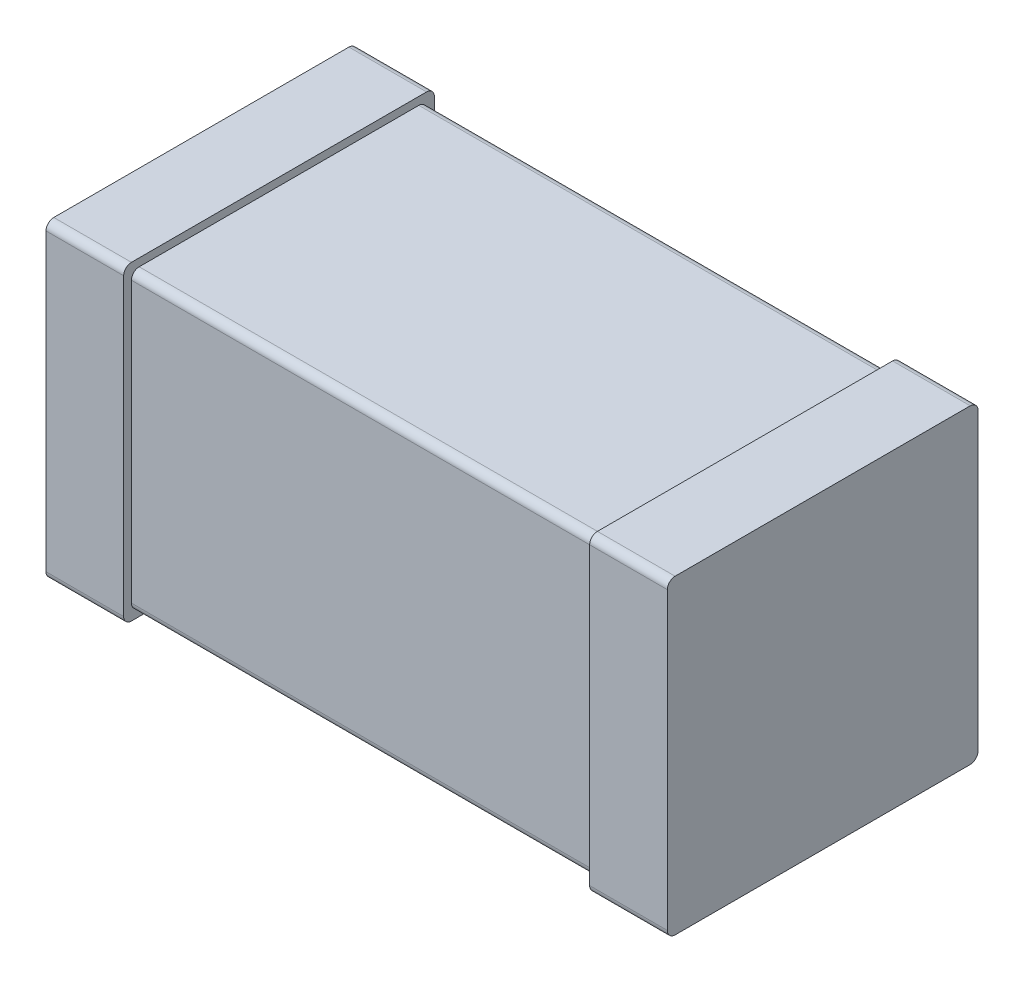
ISO-10303-21;
HEADER;
FILE_DESCRIPTION(('STEP AP214'),'2;1');
FILE_NAME('part.step','',(''),(''),'','','');
FILE_SCHEMA(('AUTOMOTIVE_DESIGN { 1 0 10303 214 1 1 1 1 }'));
ENDSEC;
DATA;
#1=APPLICATION_CONTEXT('core data for automotive mechanical design processes');
#2=APPLICATION_PROTOCOL_DEFINITION('international standard','automotive_design',2000,#1);
#3=PRODUCT_CONTEXT('',#1,'mechanical');
#4=PRODUCT('Part','Part','',(#3));
#5=PRODUCT_RELATED_PRODUCT_CATEGORY('part','',(#4));
#6=PRODUCT_DEFINITION_FORMATION('','',#4);
#7=PRODUCT_DEFINITION_CONTEXT('part definition',#1,'design');
#8=PRODUCT_DEFINITION('design','',#6,#7);
#9=PRODUCT_DEFINITION_SHAPE('','',#8);
#10=(LENGTH_UNIT() NAMED_UNIT(*) SI_UNIT(.MILLI.,.METRE.));
#11=(NAMED_UNIT(*) PLANE_ANGLE_UNIT() SI_UNIT($,.RADIAN.));
#12=(NAMED_UNIT(*) SI_UNIT($,.STERADIAN.) SOLID_ANGLE_UNIT());
#13=UNCERTAINTY_MEASURE_WITH_UNIT(LENGTH_MEASURE(1.E-05),#10,'distance_accuracy_value','');
#14=(GEOMETRIC_REPRESENTATION_CONTEXT(3) GLOBAL_UNCERTAINTY_ASSIGNED_CONTEXT((#13)) GLOBAL_UNIT_ASSIGNED_CONTEXT((#10,
#11,#12)) REPRESENTATION_CONTEXT('',''));
#15=CARTESIAN_POINT('',(0.,0.,0.));
#16=DIRECTION('',(0.,0.,1.));
#17=DIRECTION('',(1.,0.,0.));
#18=AXIS2_PLACEMENT_3D('',#15,#16,#17);
#19=CARTESIAN_POINT('',(-1.6,-0.8,0.));
#20=DIRECTION('',(1.,0.,0.));
#21=DIRECTION('',(0.,1.,0.));
#22=AXIS2_PLACEMENT_3D('',#19,#20,#21);
#23=PLANE('',#22);
#24=CARTESIAN_POINT('',(-1.6,-0.76,1.56));
#25=DIRECTION('',(-1.,0.,0.));
#26=DIRECTION('',(0.,0.,1.));
#27=AXIS2_PLACEMENT_3D('',#24,#25,#26);
#28=CIRCLE('',#27,0.04);
#29=CARTESIAN_POINT('',(-1.6,-0.8,1.56));
#30=VERTEX_POINT('',#29);
#31=CARTESIAN_POINT('',(-1.6,-0.76,1.6));
#32=VERTEX_POINT('',#31);
#33=EDGE_CURVE('E11',#30,#32,#28,.T.);
#34=ORIENTED_EDGE('',*,*,#33,.T.);
#35=DIRECTION('',(0.,1.,0.));
#36=VECTOR('',#35,1.);
#37=CARTESIAN_POINT('',(-1.6,-0.8,1.6));
#38=LINE('',#37,#36);
#39=CARTESIAN_POINT('',(-1.6,0.76,1.6));
#40=VERTEX_POINT('',#39);
#41=EDGE_CURVE('E27',#32,#40,#38,.T.);
#42=ORIENTED_EDGE('',*,*,#41,.T.);
#43=CARTESIAN_POINT('',(-1.6,0.76,1.56));
#44=DIRECTION('',(1.,0.,0.));
#45=DIRECTION('',(0.,0.,1.));
#46=AXIS2_PLACEMENT_3D('',#43,#44,#45);
#47=CIRCLE('',#46,0.04);
#48=CARTESIAN_POINT('',(-1.6,0.8,1.56));
#49=VERTEX_POINT('',#48);
#50=EDGE_CURVE('E331',#49,#40,#47,.T.);
#51=ORIENTED_EDGE('',*,*,#50,.F.);
#52=DIRECTION('',(0.,0.,1.));
#53=VECTOR('',#52,1.);
#54=CARTESIAN_POINT('',(-1.6,0.8,0.));
#55=LINE('',#54,#53);
#56=CARTESIAN_POINT('',(-1.6,0.8,0.04));
#57=VERTEX_POINT('',#56);
#58=EDGE_CURVE('E340',#57,#49,#55,.T.);
#59=ORIENTED_EDGE('',*,*,#58,.F.);
#60=CARTESIAN_POINT('',(-1.6,0.76,0.04));
#61=DIRECTION('',(-1.,0.,0.));
#62=DIRECTION('',(0.,0.,1.));
#63=AXIS2_PLACEMENT_3D('',#60,#61,#62);
#64=CIRCLE('',#63,0.04);
#65=CARTESIAN_POINT('',(-1.6,0.76,0.));
#66=VERTEX_POINT('',#65);
#67=EDGE_CURVE('E400',#57,#66,#64,.T.);
#68=ORIENTED_EDGE('',*,*,#67,.T.);
#69=DIRECTION('',(0.,1.,0.));
#70=VECTOR('',#69,1.);
#71=CARTESIAN_POINT('',(-1.6,-0.8,0.));
#72=LINE('',#71,#70);
#73=CARTESIAN_POINT('',(-1.6,-0.76,0.));
#74=VERTEX_POINT('',#73);
#75=EDGE_CURVE('E304',#74,#66,#72,.T.);
#76=ORIENTED_EDGE('',*,*,#75,.F.);
#77=CARTESIAN_POINT('',(-1.6,-0.76,0.04));
#78=DIRECTION('',(1.,0.,0.));
#79=DIRECTION('',(0.,0.,1.));
#80=AXIS2_PLACEMENT_3D('',#77,#78,#79);
#81=CIRCLE('',#80,0.04);
#82=CARTESIAN_POINT('',(-1.6,-0.8,0.04));
#83=VERTEX_POINT('',#82);
#84=EDGE_CURVE('E293',#83,#74,#81,.T.);
#85=ORIENTED_EDGE('',*,*,#84,.F.);
#86=DIRECTION('',(0.,0.,1.));
#87=VECTOR('',#86,1.);
#88=CARTESIAN_POINT('',(-1.6,-0.8,0.));
#89=LINE('',#88,#87);
#90=EDGE_CURVE('E373',#83,#30,#89,.T.);
#91=ORIENTED_EDGE('',*,*,#90,.T.);
#92=EDGE_LOOP('',(#34,#42,#51,#59,#68,#76,#85,#91));
#93=FACE_BOUND('',#92,.T.);
#94=ADVANCED_FACE('F16',(#93),#23,.F.);
#95=CARTESIAN_POINT('',(-1.6,-0.8,0.));
#96=DIRECTION('',(0.,1.,0.));
#97=DIRECTION('',(1.,0.,0.));
#98=AXIS2_PLACEMENT_3D('',#95,#96,#97);
#99=PLANE('',#98);
#100=DIRECTION('',(1.,0.,0.));
#101=VECTOR('',#100,1.);
#102=CARTESIAN_POINT('',(-1.6,-0.8,1.56));
#103=LINE('',#102,#101);
#104=CARTESIAN_POINT('',(-1.2,-0.8,1.56));
#105=VERTEX_POINT('',#104);
#106=EDGE_CURVE('E412',#30,#105,#103,.T.);
#107=ORIENTED_EDGE('',*,*,#106,.F.);
#108=ORIENTED_EDGE('',*,*,#90,.F.);
#109=DIRECTION('',(1.,0.,0.));
#110=VECTOR('',#109,1.);
#111=CARTESIAN_POINT('',(-1.6,-0.8,0.04));
#112=LINE('',#111,#110);
#113=CARTESIAN_POINT('',(-1.2,-0.8,0.04));
#114=VERTEX_POINT('',#113);
#115=EDGE_CURVE('E369',#83,#114,#112,.T.);
#116=ORIENTED_EDGE('',*,*,#115,.T.);
#117=DIRECTION('',(0.,0.,1.));
#118=VECTOR('',#117,1.);
#119=CARTESIAN_POINT('',(-1.2,-0.8,0.));
#120=LINE('',#119,#118);
#121=EDGE_CURVE('E297',#114,#105,#120,.T.);
#122=ORIENTED_EDGE('',*,*,#121,.T.);
#123=EDGE_LOOP('',(#107,#108,#116,#122));
#124=FACE_BOUND('',#123,.T.);
#125=ADVANCED_FACE('F620',(#124),#99,.F.);
#126=CARTESIAN_POINT('',(-1.6,-0.76,0.04));
#127=DIRECTION('',(1.,0.,0.));
#128=DIRECTION('',(0.,-1.,0.));
#129=AXIS2_PLACEMENT_3D('',#126,#127,#128);
#130=CYLINDRICAL_SURFACE('',#129,0.04);
#131=ORIENTED_EDGE('',*,*,#84,.T.);
#132=DIRECTION('',(1.,0.,0.));
#133=VECTOR('',#132,1.);
#134=CARTESIAN_POINT('',(-1.6,-0.76,0.));
#135=LINE('',#134,#133);
#136=CARTESIAN_POINT('',(-1.2,-0.76,0.));
#137=VERTEX_POINT('',#136);
#138=EDGE_CURVE('E298',#74,#137,#135,.T.);
#139=ORIENTED_EDGE('',*,*,#138,.T.);
#140=CARTESIAN_POINT('',(-1.2,-0.76,0.04));
#141=DIRECTION('',(1.,0.,0.));
#142=DIRECTION('',(0.,0.,1.));
#143=AXIS2_PLACEMENT_3D('',#140,#141,#142);
#144=CIRCLE('',#143,0.04);
#145=EDGE_CURVE('E287',#114,#137,#144,.T.);
#146=ORIENTED_EDGE('',*,*,#145,.F.);
#147=ORIENTED_EDGE('',*,*,#115,.F.);
#148=EDGE_LOOP('',(#131,#139,#146,#147));
#149=FACE_BOUND('',#148,.T.);
#150=ADVANCED_FACE('F616',(#149),#130,.T.);
#151=CARTESIAN_POINT('',(-1.6,-0.76,1.56));
#152=DIRECTION('',(1.,0.,0.));
#153=DIRECTION('',(0.,-1.,0.));
#154=AXIS2_PLACEMENT_3D('',#151,#152,#153);
#155=CYLINDRICAL_SURFACE('',#154,0.04);
#156=ORIENTED_EDGE('',*,*,#106,.T.);
#157=CARTESIAN_POINT('',(-1.2,-0.76,1.56));
#158=DIRECTION('',(-1.,0.,0.));
#159=DIRECTION('',(0.,0.,1.));
#160=AXIS2_PLACEMENT_3D('',#157,#158,#159);
#161=CIRCLE('',#160,0.04);
#162=CARTESIAN_POINT('',(-1.2,-0.76,1.6));
#163=VERTEX_POINT('',#162);
#164=EDGE_CURVE('E303',#105,#163,#161,.T.);
#165=ORIENTED_EDGE('',*,*,#164,.T.);
#166=DIRECTION('',(1.,0.,0.));
#167=VECTOR('',#166,1.);
#168=CARTESIAN_POINT('',(-1.6,-0.76,1.6));
#169=LINE('',#168,#167);
#170=EDGE_CURVE('E408',#32,#163,#169,.T.);
#171=ORIENTED_EDGE('',*,*,#170,.F.);
#172=ORIENTED_EDGE('',*,*,#33,.F.);
#173=EDGE_LOOP('',(#156,#165,#171,#172));
#174=FACE_BOUND('',#173,.T.);
#175=ADVANCED_FACE('F529',(#174),#155,.T.);
#176=CARTESIAN_POINT('',(-1.6,-0.8,0.));
#177=DIRECTION('',(0.,0.,1.));
#178=DIRECTION('',(1.,0.,0.));
#179=AXIS2_PLACEMENT_3D('',#176,#177,#178);
#180=PLANE('',#179);
#181=DIRECTION('',(1.,0.,0.));
#182=VECTOR('',#181,1.);
#183=CARTESIAN_POINT('',(-1.6,0.76,0.));
#184=LINE('',#183,#182);
#185=CARTESIAN_POINT('',(-1.2,0.76,0.));
#186=VERTEX_POINT('',#185);
#187=EDGE_CURVE('E299',#66,#186,#184,.T.);
#188=ORIENTED_EDGE('',*,*,#187,.T.);
#189=DIRECTION('',(0.,1.,0.));
#190=VECTOR('',#189,1.);
#191=CARTESIAN_POINT('',(-1.2,-0.8,0.));
#192=LINE('',#191,#190);
#193=EDGE_CURVE('E351',#137,#186,#192,.T.);
#194=ORIENTED_EDGE('',*,*,#193,.F.);
#195=ORIENTED_EDGE('',*,*,#138,.F.);
#196=ORIENTED_EDGE('',*,*,#75,.T.);
#197=EDGE_LOOP('',(#188,#194,#195,#196));
#198=FACE_BOUND('',#197,.T.);
#199=ADVANCED_FACE('F524',(#198),#180,.F.);
#200=CARTESIAN_POINT('',(-1.6,-0.8,1.6));
#201=DIRECTION('',(0.,0.,1.));
#202=DIRECTION('',(1.,0.,0.));
#203=AXIS2_PLACEMENT_3D('',#200,#201,#202);
#204=PLANE('',#203);
#205=ORIENTED_EDGE('',*,*,#41,.F.);
#206=ORIENTED_EDGE('',*,*,#170,.T.);
#207=DIRECTION('',(0.,1.,0.));
#208=VECTOR('',#207,1.);
#209=CARTESIAN_POINT('',(-1.2,-0.8,1.6));
#210=LINE('',#209,#208);
#211=CARTESIAN_POINT('',(-1.2,0.76,1.6));
#212=VERTEX_POINT('',#211);
#213=EDGE_CURVE('E405',#163,#212,#210,.T.);
#214=ORIENTED_EDGE('',*,*,#213,.T.);
#215=DIRECTION('',(1.,0.,0.));
#216=VECTOR('',#215,1.);
#217=CARTESIAN_POINT('',(-1.6,0.76,1.6));
#218=LINE('',#217,#216);
#219=EDGE_CURVE('E333',#40,#212,#218,.T.);
#220=ORIENTED_EDGE('',*,*,#219,.F.);
#221=EDGE_LOOP('',(#205,#206,#214,#220));
#222=FACE_BOUND('',#221,.T.);
#223=ADVANCED_FACE('F528',(#222),#204,.T.);
#224=CARTESIAN_POINT('',(-1.6,0.76,0.04));
#225=DIRECTION('',(1.,0.,0.));
#226=DIRECTION('',(0.,1.,0.));
#227=AXIS2_PLACEMENT_3D('',#224,#225,#226);
#228=CYLINDRICAL_SURFACE('',#227,0.04);
#229=DIRECTION('',(1.,0.,0.));
#230=VECTOR('',#229,1.);
#231=CARTESIAN_POINT('',(-1.6,0.8,0.04));
#232=LINE('',#231,#230);
#233=CARTESIAN_POINT('',(-1.2,0.8,0.04));
#234=VERTEX_POINT('',#233);
#235=EDGE_CURVE('E337',#57,#234,#232,.T.);
#236=ORIENTED_EDGE('',*,*,#235,.T.);
#237=CARTESIAN_POINT('',(-1.2,0.76,0.04));
#238=DIRECTION('',(-1.,0.,0.));
#239=DIRECTION('',(0.,0.,1.));
#240=AXIS2_PLACEMENT_3D('',#237,#238,#239);
#241=CIRCLE('',#240,0.04);
#242=EDGE_CURVE('E127',#234,#186,#241,.T.);
#243=ORIENTED_EDGE('',*,*,#242,.T.);
#244=ORIENTED_EDGE('',*,*,#187,.F.);
#245=ORIENTED_EDGE('',*,*,#67,.F.);
#246=EDGE_LOOP('',(#236,#243,#244,#245));
#247=FACE_BOUND('',#246,.T.);
#248=ADVANCED_FACE('F548',(#247),#228,.T.);
#249=CARTESIAN_POINT('',(-1.6,0.76,1.56));
#250=DIRECTION('',(1.,0.,0.));
#251=DIRECTION('',(0.,1.,0.));
#252=AXIS2_PLACEMENT_3D('',#249,#250,#251);
#253=CYLINDRICAL_SURFACE('',#252,0.04);
#254=ORIENTED_EDGE('',*,*,#50,.T.);
#255=ORIENTED_EDGE('',*,*,#219,.T.);
#256=CARTESIAN_POINT('',(-1.2,0.76,1.56));
#257=DIRECTION('',(1.,0.,0.));
#258=DIRECTION('',(0.,0.,1.));
#259=AXIS2_PLACEMENT_3D('',#256,#257,#258);
#260=CIRCLE('',#259,0.04);
#261=CARTESIAN_POINT('',(-1.2,0.8,1.56));
#262=VERTEX_POINT('',#261);
#263=EDGE_CURVE('E142',#262,#212,#260,.T.);
#264=ORIENTED_EDGE('',*,*,#263,.F.);
#265=DIRECTION('',(1.,0.,0.));
#266=VECTOR('',#265,1.);
#267=CARTESIAN_POINT('',(-1.6,0.8,1.56));
#268=LINE('',#267,#266);
#269=EDGE_CURVE('E347',#49,#262,#268,.T.);
#270=ORIENTED_EDGE('',*,*,#269,.F.);
#271=EDGE_LOOP('',(#254,#255,#264,#270));
#272=FACE_BOUND('',#271,.T.);
#273=ADVANCED_FACE('F552',(#272),#253,.T.);
#274=CARTESIAN_POINT('',(-1.6,0.8,0.));
#275=DIRECTION('',(0.,1.,0.));
#276=DIRECTION('',(1.,0.,0.));
#277=AXIS2_PLACEMENT_3D('',#274,#275,#276);
#278=PLANE('',#277);
#279=DIRECTION('',(0.,0.,1.));
#280=VECTOR('',#279,1.);
#281=CARTESIAN_POINT('',(-1.2,0.8,0.));
#282=LINE('',#281,#280);
#283=EDGE_CURVE('E450',#234,#262,#282,.T.);
#284=ORIENTED_EDGE('',*,*,#283,.F.);
#285=ORIENTED_EDGE('',*,*,#235,.F.);
#286=ORIENTED_EDGE('',*,*,#58,.T.);
#287=ORIENTED_EDGE('',*,*,#269,.T.);
#288=EDGE_LOOP('',(#284,#285,#286,#287));
#289=FACE_BOUND('',#288,.T.);
#290=ADVANCED_FACE('F630',(#289),#278,.T.);
#291=CARTESIAN_POINT('',(-1.2,-0.8,0.));
#292=DIRECTION('',(1.,0.,0.));
#293=DIRECTION('',(0.,1.,0.));
#294=AXIS2_PLACEMENT_3D('',#291,#292,#293);
#295=PLANE('',#294);
#296=ORIENTED_EDGE('',*,*,#121,.F.);
#297=ORIENTED_EDGE('',*,*,#145,.T.);
#298=ORIENTED_EDGE('',*,*,#193,.T.);
#299=ORIENTED_EDGE('',*,*,#242,.F.);
#300=ORIENTED_EDGE('',*,*,#283,.T.);
#301=ORIENTED_EDGE('',*,*,#263,.T.);
#302=ORIENTED_EDGE('',*,*,#213,.F.);
#303=ORIENTED_EDGE('',*,*,#164,.F.);
#304=EDGE_LOOP('',(#296,#297,#298,#299,#300,#301,#302,#303));
#305=FACE_BOUND('',#304,.T.);
#306=CARTESIAN_POINT('',(-1.2,-0.72,0.08));
#307=DIRECTION('',(1.,0.,0.));
#308=DIRECTION('',(0.,0.,1.));
#309=AXIS2_PLACEMENT_3D('',#306,#307,#308);
#310=CIRCLE('',#309,0.04);
#311=CARTESIAN_POINT('',(-1.2,-0.76,0.08));
#312=VERTEX_POINT('',#311);
#313=CARTESIAN_POINT('',(-1.2,-0.72,0.04));
#314=VERTEX_POINT('',#313);
#315=EDGE_CURVE('E305',#312,#314,#310,.T.);
#316=ORIENTED_EDGE('',*,*,#315,.F.);
#317=DIRECTION('',(0.,0.,1.));
#318=VECTOR('',#317,1.);
#319=CARTESIAN_POINT('',(-1.2,-0.76,0.04));
#320=LINE('',#319,#318);
#321=CARTESIAN_POINT('',(-1.2,-0.76,1.52));
#322=VERTEX_POINT('',#321);
#323=EDGE_CURVE('E418',#312,#322,#320,.T.);
#324=ORIENTED_EDGE('',*,*,#323,.T.);
#325=CARTESIAN_POINT('',(-1.2,-0.72,1.52));
#326=DIRECTION('',(-1.,0.,0.));
#327=DIRECTION('',(0.,0.,1.));
#328=AXIS2_PLACEMENT_3D('',#325,#326,#327);
#329=CIRCLE('',#328,0.04);
#330=CARTESIAN_POINT('',(-1.2,-0.72,1.56));
#331=VERTEX_POINT('',#330);
#332=EDGE_CURVE('E391',#322,#331,#329,.T.);
#333=ORIENTED_EDGE('',*,*,#332,.T.);
#334=DIRECTION('',(0.,1.,0.));
#335=VECTOR('',#334,1.);
#336=CARTESIAN_POINT('',(-1.2,-0.76,1.56));
#337=LINE('',#336,#335);
#338=CARTESIAN_POINT('',(-1.2,0.72,1.56));
#339=VERTEX_POINT('',#338);
#340=EDGE_CURVE('E387',#331,#339,#337,.T.);
#341=ORIENTED_EDGE('',*,*,#340,.T.);
#342=CARTESIAN_POINT('',(-1.2,0.72,1.52));
#343=DIRECTION('',(1.,0.,0.));
#344=DIRECTION('',(0.,0.,1.));
#345=AXIS2_PLACEMENT_3D('',#342,#343,#344);
#346=CIRCLE('',#345,0.04);
#347=CARTESIAN_POINT('',(-1.2,0.76,1.52));
#348=VERTEX_POINT('',#347);
#349=EDGE_CURVE('E326',#348,#339,#346,.T.);
#350=ORIENTED_EDGE('',*,*,#349,.F.);
#351=DIRECTION('',(0.,0.,1.));
#352=VECTOR('',#351,1.);
#353=CARTESIAN_POINT('',(-1.2,0.76,0.04));
#354=LINE('',#353,#352);
#355=CARTESIAN_POINT('',(-1.2,0.76,0.08));
#356=VERTEX_POINT('',#355);
#357=EDGE_CURVE('E395',#356,#348,#354,.T.);
#358=ORIENTED_EDGE('',*,*,#357,.F.);
#359=CARTESIAN_POINT('',(-1.2,0.72,0.08));
#360=DIRECTION('',(-1.,0.,0.));
#361=DIRECTION('',(0.,0.,1.));
#362=AXIS2_PLACEMENT_3D('',#359,#360,#361);
#363=CIRCLE('',#362,0.04);
#364=CARTESIAN_POINT('',(-1.2,0.72,0.04));
#365=VERTEX_POINT('',#364);
#366=EDGE_CURVE('E309',#356,#365,#363,.T.);
#367=ORIENTED_EDGE('',*,*,#366,.T.);
#368=DIRECTION('',(0.,1.,0.));
#369=VECTOR('',#368,1.);
#370=CARTESIAN_POINT('',(-1.2,-0.76,0.04));
#371=LINE('',#370,#369);
#372=EDGE_CURVE('E311',#314,#365,#371,.T.);
#373=ORIENTED_EDGE('',*,*,#372,.F.);
#374=EDGE_LOOP('',(#316,#324,#333,#341,#350,#358,#367,#373));
#375=FACE_BOUND('',#374,.T.);
#376=ADVANCED_FACE('F488',(#305,#375),#295,.T.);
#377=CARTESIAN_POINT('',(-1.2,-0.72,0.08));
#378=DIRECTION('',(1.,0.,0.));
#379=DIRECTION('',(0.,-1.,0.));
#380=AXIS2_PLACEMENT_3D('',#377,#378,#379);
#381=CYLINDRICAL_SURFACE('',#380,0.04);
#382=ORIENTED_EDGE('',*,*,#315,.T.);
#383=DIRECTION('',(1.,0.,0.));
#384=VECTOR('',#383,1.);
#385=CARTESIAN_POINT('',(-1.2,-0.72,0.04));
#386=LINE('',#385,#384);
#387=CARTESIAN_POINT('',(1.2,-0.72,0.04));
#388=VERTEX_POINT('',#387);
#389=EDGE_CURVE('E310',#314,#388,#386,.T.);
#390=ORIENTED_EDGE('',*,*,#389,.T.);
#391=CARTESIAN_POINT('',(1.2,-0.72,0.08));
#392=DIRECTION('',(1.,0.,0.));
#393=DIRECTION('',(0.,0.,1.));
#394=AXIS2_PLACEMENT_3D('',#391,#392,#393);
#395=CIRCLE('',#394,0.04);
#396=CARTESIAN_POINT('',(1.2,-0.76,0.08));
#397=VERTEX_POINT('',#396);
#398=EDGE_CURVE('E291',#397,#388,#395,.T.);
#399=ORIENTED_EDGE('',*,*,#398,.F.);
#400=DIRECTION('',(1.,0.,0.));
#401=VECTOR('',#400,1.);
#402=CARTESIAN_POINT('',(-1.2,-0.76,0.08));
#403=LINE('',#402,#401);
#404=EDGE_CURVE('E365',#312,#397,#403,.T.);
#405=ORIENTED_EDGE('',*,*,#404,.F.);
#406=EDGE_LOOP('',(#382,#390,#399,#405));
#407=FACE_BOUND('',#406,.T.);
#408=ADVANCED_FACE('F536',(#407),#381,.T.);
#409=CARTESIAN_POINT('',(-1.2,-0.76,0.04));
#410=DIRECTION('',(0.,0.,1.));
#411=DIRECTION('',(1.,0.,0.));
#412=AXIS2_PLACEMENT_3D('',#409,#410,#411);
#413=PLANE('',#412);
#414=DIRECTION('',(1.,0.,0.));
#415=VECTOR('',#414,1.);
#416=CARTESIAN_POINT('',(-1.2,0.72,0.04));
#417=LINE('',#416,#415);
#418=CARTESIAN_POINT('',(1.2,0.72,0.04));
#419=VERTEX_POINT('',#418);
#420=EDGE_CURVE('E314',#365,#419,#417,.T.);
#421=ORIENTED_EDGE('',*,*,#420,.T.);
#422=DIRECTION('',(0.,1.,0.));
#423=VECTOR('',#422,1.);
#424=CARTESIAN_POINT('',(1.2,-0.76,0.04));
#425=LINE('',#424,#423);
#426=EDGE_CURVE('E259',#388,#419,#425,.T.);
#427=ORIENTED_EDGE('',*,*,#426,.F.);
#428=ORIENTED_EDGE('',*,*,#389,.F.);
#429=ORIENTED_EDGE('',*,*,#372,.T.);
#430=EDGE_LOOP('',(#421,#427,#428,#429));
#431=FACE_BOUND('',#430,.T.);
#432=ADVANCED_FACE('F540',(#431),#413,.F.);
#433=CARTESIAN_POINT('',(-1.2,0.72,0.08));
#434=DIRECTION('',(1.,0.,0.));
#435=DIRECTION('',(0.,1.,0.));
#436=AXIS2_PLACEMENT_3D('',#433,#434,#435);
#437=CYLINDRICAL_SURFACE('',#436,0.04);
#438=DIRECTION('',(1.,0.,0.));
#439=VECTOR('',#438,1.);
#440=CARTESIAN_POINT('',(-1.2,0.76,0.08));
#441=LINE('',#440,#439);
#442=CARTESIAN_POINT('',(1.2,0.76,0.08));
#443=VERTEX_POINT('',#442);
#444=EDGE_CURVE('E315',#356,#443,#441,.T.);
#445=ORIENTED_EDGE('',*,*,#444,.T.);
#446=CARTESIAN_POINT('',(1.2,0.72,0.08));
#447=DIRECTION('',(-1.,0.,0.));
#448=DIRECTION('',(0.,0.,1.));
#449=AXIS2_PLACEMENT_3D('',#446,#447,#448);
#450=CIRCLE('',#449,0.04);
#451=EDGE_CURVE('E325',#443,#419,#450,.T.);
#452=ORIENTED_EDGE('',*,*,#451,.T.);
#453=ORIENTED_EDGE('',*,*,#420,.F.);
#454=ORIENTED_EDGE('',*,*,#366,.F.);
#455=EDGE_LOOP('',(#445,#452,#453,#454));
#456=FACE_BOUND('',#455,.T.);
#457=ADVANCED_FACE('F505',(#456),#437,.T.);
#458=CARTESIAN_POINT('',(-1.2,0.76,0.04));
#459=DIRECTION('',(0.,1.,0.));
#460=DIRECTION('',(1.,0.,0.));
#461=AXIS2_PLACEMENT_3D('',#458,#459,#460);
#462=PLANE('',#461);
#463=DIRECTION('',(0.,0.,1.));
#464=VECTOR('',#463,1.);
#465=CARTESIAN_POINT('',(1.2,0.76,0.04));
#466=LINE('',#465,#464);
#467=CARTESIAN_POINT('',(1.2,0.76,1.52));
#468=VERTEX_POINT('',#467);
#469=EDGE_CURVE('E290',#443,#468,#466,.T.);
#470=ORIENTED_EDGE('',*,*,#469,.F.);
#471=ORIENTED_EDGE('',*,*,#444,.F.);
#472=ORIENTED_EDGE('',*,*,#357,.T.);
#473=DIRECTION('',(1.,0.,0.));
#474=VECTOR('',#473,1.);
#475=CARTESIAN_POINT('',(-1.2,0.76,1.52));
#476=LINE('',#475,#474);
#477=EDGE_CURVE('E328',#348,#468,#476,.T.);
#478=ORIENTED_EDGE('',*,*,#477,.T.);
#479=EDGE_LOOP('',(#470,#471,#472,#478));
#480=FACE_BOUND('',#479,.T.);
#481=ADVANCED_FACE('F499',(#480),#462,.T.);
#482=CARTESIAN_POINT('',(-1.2,0.72,1.52));
#483=DIRECTION('',(1.,0.,0.));
#484=DIRECTION('',(0.,1.,0.));
#485=AXIS2_PLACEMENT_3D('',#482,#483,#484);
#486=CYLINDRICAL_SURFACE('',#485,0.04);
#487=ORIENTED_EDGE('',*,*,#349,.T.);
#488=DIRECTION('',(1.,0.,0.));
#489=VECTOR('',#488,1.);
#490=CARTESIAN_POINT('',(-1.2,0.72,1.56));
#491=LINE('',#490,#489);
#492=CARTESIAN_POINT('',(1.2,0.72,1.56));
#493=VERTEX_POINT('',#492);
#494=EDGE_CURVE('E329',#339,#493,#491,.T.);
#495=ORIENTED_EDGE('',*,*,#494,.T.);
#496=CARTESIAN_POINT('',(1.2,0.72,1.52));
#497=DIRECTION('',(1.,0.,0.));
#498=DIRECTION('',(0.,0.,1.));
#499=AXIS2_PLACEMENT_3D('',#496,#497,#498);
#500=CIRCLE('',#499,0.04);
#501=EDGE_CURVE('E289',#468,#493,#500,.T.);
#502=ORIENTED_EDGE('',*,*,#501,.F.);
#503=ORIENTED_EDGE('',*,*,#477,.F.);
#504=EDGE_LOOP('',(#487,#495,#502,#503));
#505=FACE_BOUND('',#504,.T.);
#506=ADVANCED_FACE('F18',(#505),#486,.T.);
#507=CARTESIAN_POINT('',(-1.2,-0.76,1.56));
#508=DIRECTION('',(0.,0.,1.));
#509=DIRECTION('',(1.,0.,0.));
#510=AXIS2_PLACEMENT_3D('',#507,#508,#509);
#511=PLANE('',#510);
#512=ORIENTED_EDGE('',*,*,#340,.F.);
#513=DIRECTION('',(1.,0.,0.));
#514=VECTOR('',#513,1.);
#515=CARTESIAN_POINT('',(-1.2,-0.72,1.56));
#516=LINE('',#515,#514);
#517=CARTESIAN_POINT('',(1.2,-0.72,1.56));
#518=VERTEX_POINT('',#517);
#519=EDGE_CURVE('E356',#331,#518,#516,.T.);
#520=ORIENTED_EDGE('',*,*,#519,.T.);
#521=DIRECTION('',(0.,1.,0.));
#522=VECTOR('',#521,1.);
#523=CARTESIAN_POINT('',(1.2,-0.76,1.56));
#524=LINE('',#523,#522);
#525=EDGE_CURVE('E353',#518,#493,#524,.T.);
#526=ORIENTED_EDGE('',*,*,#525,.T.);
#527=ORIENTED_EDGE('',*,*,#494,.F.);
#528=EDGE_LOOP('',(#512,#520,#526,#527));
#529=FACE_BOUND('',#528,.T.);
#530=ADVANCED_FACE('F475',(#529),#511,.T.);
#531=CARTESIAN_POINT('',(-1.2,-0.72,1.52));
#532=DIRECTION('',(1.,0.,0.));
#533=DIRECTION('',(0.,-1.,0.));
#534=AXIS2_PLACEMENT_3D('',#531,#532,#533);
#535=CYLINDRICAL_SURFACE('',#534,0.04);
#536=DIRECTION('',(1.,0.,0.));
#537=VECTOR('',#536,1.);
#538=CARTESIAN_POINT('',(-1.2,-0.76,1.52));
#539=LINE('',#538,#537);
#540=CARTESIAN_POINT('',(1.2,-0.76,1.52));
#541=VERTEX_POINT('',#540);
#542=EDGE_CURVE('E357',#322,#541,#539,.T.);
#543=ORIENTED_EDGE('',*,*,#542,.T.);
#544=CARTESIAN_POINT('',(1.2,-0.72,1.52));
#545=DIRECTION('',(-1.,0.,0.));
#546=DIRECTION('',(0.,0.,1.));
#547=AXIS2_PLACEMENT_3D('',#544,#545,#546);
#548=CIRCLE('',#547,0.04);
#549=EDGE_CURVE('E361',#541,#518,#548,.T.);
#550=ORIENTED_EDGE('',*,*,#549,.T.);
#551=ORIENTED_EDGE('',*,*,#519,.F.);
#552=ORIENTED_EDGE('',*,*,#332,.F.);
#553=EDGE_LOOP('',(#543,#550,#551,#552));
#554=FACE_BOUND('',#553,.T.);
#555=ADVANCED_FACE('F478',(#554),#535,.T.);
#556=CARTESIAN_POINT('',(-1.2,-0.76,0.04));
#557=DIRECTION('',(0.,1.,0.));
#558=DIRECTION('',(1.,0.,0.));
#559=AXIS2_PLACEMENT_3D('',#556,#557,#558);
#560=PLANE('',#559);
#561=ORIENTED_EDGE('',*,*,#542,.F.);
#562=ORIENTED_EDGE('',*,*,#323,.F.);
#563=ORIENTED_EDGE('',*,*,#404,.T.);
#564=DIRECTION('',(0.,0.,1.));
#565=VECTOR('',#564,1.);
#566=CARTESIAN_POINT('',(1.2,-0.76,0.04));
#567=LINE('',#566,#565);
#568=EDGE_CURVE('E20',#397,#541,#567,.T.);
#569=ORIENTED_EDGE('',*,*,#568,.T.);
#570=EDGE_LOOP('',(#561,#562,#563,#569));
#571=FACE_BOUND('',#570,.T.);
#572=ADVANCED_FACE('F492',(#571),#560,.F.);
#573=CARTESIAN_POINT('',(1.2,-0.8,0.));
#574=DIRECTION('',(1.,0.,0.));
#575=DIRECTION('',(0.,1.,0.));
#576=AXIS2_PLACEMENT_3D('',#573,#574,#575);
#577=PLANE('',#576);
#578=CARTESIAN_POINT('',(1.2,-0.76,1.56));
#579=DIRECTION('',(-1.,0.,0.));
#580=DIRECTION('',(0.,0.,1.));
#581=AXIS2_PLACEMENT_3D('',#578,#579,#580);
#582=CIRCLE('',#581,0.04);
#583=CARTESIAN_POINT('',(1.2,-0.8,1.56));
#584=VERTEX_POINT('',#583);
#585=CARTESIAN_POINT('',(1.2,-0.76,1.6));
#586=VERTEX_POINT('',#585);
#587=EDGE_CURVE('E250',#584,#586,#582,.T.);
#588=ORIENTED_EDGE('',*,*,#587,.T.);
#589=DIRECTION('',(0.,1.,0.));
#590=VECTOR('',#589,1.);
#591=CARTESIAN_POINT('',(1.2,-0.8,1.6));
#592=LINE('',#591,#590);
#593=CARTESIAN_POINT('',(1.2,0.76,1.6));
#594=VERTEX_POINT('',#593);
#595=EDGE_CURVE('E268',#586,#594,#592,.T.);
#596=ORIENTED_EDGE('',*,*,#595,.T.);
#597=CARTESIAN_POINT('',(1.2,0.76,1.56));
#598=DIRECTION('',(1.,0.,0.));
#599=DIRECTION('',(0.,0.,1.));
#600=AXIS2_PLACEMENT_3D('',#597,#598,#599);
#601=CIRCLE('',#600,0.04);
#602=CARTESIAN_POINT('',(1.2,0.8,1.56));
#603=VERTEX_POINT('',#602);
#604=EDGE_CURVE('E374',#603,#594,#601,.T.);
#605=ORIENTED_EDGE('',*,*,#604,.F.);
#606=DIRECTION('',(0.,0.,1.));
#607=VECTOR('',#606,1.);
#608=CARTESIAN_POINT('',(1.2,0.8,0.));
#609=LINE('',#608,#607);
#610=CARTESIAN_POINT('',(1.2,0.8,0.04));
#611=VERTEX_POINT('',#610);
#612=EDGE_CURVE('E428',#611,#603,#609,.T.);
#613=ORIENTED_EDGE('',*,*,#612,.F.);
#614=CARTESIAN_POINT('',(1.2,0.76,0.04));
#615=DIRECTION('',(-1.,0.,0.));
#616=DIRECTION('',(0.,0.,1.));
#617=AXIS2_PLACEMENT_3D('',#614,#615,#616);
#618=CIRCLE('',#617,0.04);
#619=CARTESIAN_POINT('',(1.2,0.76,0.));
#620=VERTEX_POINT('',#619);
#621=EDGE_CURVE('E258',#611,#620,#618,.T.);
#622=ORIENTED_EDGE('',*,*,#621,.T.);
#623=DIRECTION('',(0.,1.,0.));
#624=VECTOR('',#623,1.);
#625=CARTESIAN_POINT('',(1.2,-0.8,0.));
#626=LINE('',#625,#624);
#627=CARTESIAN_POINT('',(1.2,-0.76,0.));
#628=VERTEX_POINT('',#627);
#629=EDGE_CURVE('E207',#628,#620,#626,.T.);
#630=ORIENTED_EDGE('',*,*,#629,.F.);
#631=CARTESIAN_POINT('',(1.2,-0.76,0.04));
#632=DIRECTION('',(1.,0.,0.));
#633=DIRECTION('',(0.,0.,1.));
#634=AXIS2_PLACEMENT_3D('',#631,#632,#633);
#635=CIRCLE('',#634,0.04);
#636=CARTESIAN_POINT('',(1.2,-0.8,0.04));
#637=VERTEX_POINT('',#636);
#638=EDGE_CURVE('E252',#637,#628,#635,.T.);
#639=ORIENTED_EDGE('',*,*,#638,.F.);
#640=DIRECTION('',(0.,0.,1.));
#641=VECTOR('',#640,1.);
#642=CARTESIAN_POINT('',(1.2,-0.8,0.));
#643=LINE('',#642,#641);
#644=EDGE_CURVE('E245',#637,#584,#643,.T.);
#645=ORIENTED_EDGE('',*,*,#644,.T.);
#646=EDGE_LOOP('',(#588,#596,#605,#613,#622,#630,#639,#645));
#647=FACE_BOUND('',#646,.T.);
#648=ORIENTED_EDGE('',*,*,#426,.T.);
#649=ORIENTED_EDGE('',*,*,#451,.F.);
#650=ORIENTED_EDGE('',*,*,#469,.T.);
#651=ORIENTED_EDGE('',*,*,#501,.T.);
#652=ORIENTED_EDGE('',*,*,#525,.F.);
#653=ORIENTED_EDGE('',*,*,#549,.F.);
#654=ORIENTED_EDGE('',*,*,#568,.F.);
#655=ORIENTED_EDGE('',*,*,#398,.T.);
#656=EDGE_LOOP('',(#648,#649,#650,#651,#652,#653,#654,#655));
#657=FACE_BOUND('',#656,.T.);
#658=ADVANCED_FACE('F247',(#647,#657),#577,.F.);
#659=CARTESIAN_POINT('',(1.2,-0.8,0.));
#660=DIRECTION('',(0.,1.,0.));
#661=DIRECTION('',(1.,0.,0.));
#662=AXIS2_PLACEMENT_3D('',#659,#660,#661);
#663=PLANE('',#662);
#664=DIRECTION('',(1.,0.,0.));
#665=VECTOR('',#664,1.);
#666=CARTESIAN_POINT('',(1.2,-0.8,1.56));
#667=LINE('',#666,#665);
#668=CARTESIAN_POINT('',(1.6,-0.8,1.56));
#669=VERTEX_POINT('',#668);
#670=EDGE_CURVE('E264',#584,#669,#667,.T.);
#671=ORIENTED_EDGE('',*,*,#670,.F.);
#672=ORIENTED_EDGE('',*,*,#644,.F.);
#673=DIRECTION('',(1.,0.,0.));
#674=VECTOR('',#673,1.);
#675=CARTESIAN_POINT('',(1.2,-0.8,0.04));
#676=LINE('',#675,#674);
#677=CARTESIAN_POINT('',(1.6,-0.8,0.04));
#678=VERTEX_POINT('',#677);
#679=EDGE_CURVE('E366',#637,#678,#676,.T.);
#680=ORIENTED_EDGE('',*,*,#679,.T.);
#681=DIRECTION('',(0.,0.,1.));
#682=VECTOR('',#681,1.);
#683=CARTESIAN_POINT('',(1.6,-0.8,0.));
#684=LINE('',#683,#682);
#685=EDGE_CURVE('E271',#678,#669,#684,.T.);
#686=ORIENTED_EDGE('',*,*,#685,.T.);
#687=EDGE_LOOP('',(#671,#672,#680,#686));
#688=FACE_BOUND('',#687,.T.);
#689=ADVANCED_FACE('F270',(#688),#663,.F.);
#690=CARTESIAN_POINT('',(1.2,-0.76,0.04));
#691=DIRECTION('',(1.,0.,0.));
#692=DIRECTION('',(0.,-1.,0.));
#693=AXIS2_PLACEMENT_3D('',#690,#691,#692);
#694=CYLINDRICAL_SURFACE('',#693,0.04);
#695=ORIENTED_EDGE('',*,*,#638,.T.);
#696=DIRECTION('',(1.,0.,0.));
#697=VECTOR('',#696,1.);
#698=CARTESIAN_POINT('',(1.2,-0.76,0.));
#699=LINE('',#698,#697);
#700=CARTESIAN_POINT('',(1.6,-0.76,0.));
#701=VERTEX_POINT('',#700);
#702=EDGE_CURVE('E274',#628,#701,#699,.T.);
#703=ORIENTED_EDGE('',*,*,#702,.T.);
#704=CARTESIAN_POINT('',(1.6,-0.76,0.04));
#705=DIRECTION('',(1.,0.,0.));
#706=DIRECTION('',(0.,0.,1.));
#707=AXIS2_PLACEMENT_3D('',#704,#705,#706);
#708=CIRCLE('',#707,0.04);
#709=EDGE_CURVE('E429',#678,#701,#708,.T.);
#710=ORIENTED_EDGE('',*,*,#709,.F.);
#711=ORIENTED_EDGE('',*,*,#679,.F.);
#712=EDGE_LOOP('',(#695,#703,#710,#711));
#713=FACE_BOUND('',#712,.T.);
#714=ADVANCED_FACE('F590',(#713),#694,.T.);
#715=CARTESIAN_POINT('',(1.2,-0.76,1.56));
#716=DIRECTION('',(1.,0.,0.));
#717=DIRECTION('',(0.,-1.,0.));
#718=AXIS2_PLACEMENT_3D('',#715,#716,#717);
#719=CYLINDRICAL_SURFACE('',#718,0.04);
#720=ORIENTED_EDGE('',*,*,#670,.T.);
#721=CARTESIAN_POINT('',(1.6,-0.76,1.56));
#722=DIRECTION('',(-1.,0.,0.));
#723=DIRECTION('',(0.,0.,1.));
#724=AXIS2_PLACEMENT_3D('',#721,#722,#723);
#725=CIRCLE('',#724,0.04);
#726=CARTESIAN_POINT('',(1.6,-0.76,1.6));
#727=VERTEX_POINT('',#726);
#728=EDGE_CURVE('E275',#669,#727,#725,.T.);
#729=ORIENTED_EDGE('',*,*,#728,.T.);
#730=DIRECTION('',(1.,0.,0.));
#731=VECTOR('',#730,1.);
#732=CARTESIAN_POINT('',(1.2,-0.76,1.6));
#733=LINE('',#732,#731);
#734=EDGE_CURVE('E266',#586,#727,#733,.T.);
#735=ORIENTED_EDGE('',*,*,#734,.F.);
#736=ORIENTED_EDGE('',*,*,#587,.F.);
#737=EDGE_LOOP('',(#720,#729,#735,#736));
#738=FACE_BOUND('',#737,.T.);
#739=ADVANCED_FACE('F262',(#738),#719,.T.);
#740=CARTESIAN_POINT('',(1.2,-0.8,0.));
#741=DIRECTION('',(0.,0.,1.));
#742=DIRECTION('',(1.,0.,0.));
#743=AXIS2_PLACEMENT_3D('',#740,#741,#742);
#744=PLANE('',#743);
#745=DIRECTION('',(1.,0.,0.));
#746=VECTOR('',#745,1.);
#747=CARTESIAN_POINT('',(1.2,0.76,0.));
#748=LINE('',#747,#746);
#749=CARTESIAN_POINT('',(1.6,0.76,0.));
#750=VERTEX_POINT('',#749);
#751=EDGE_CURVE('E284',#620,#750,#748,.T.);
#752=ORIENTED_EDGE('',*,*,#751,.T.);
#753=DIRECTION('',(0.,1.,0.));
#754=VECTOR('',#753,1.);
#755=CARTESIAN_POINT('',(1.6,-0.8,0.));
#756=LINE('',#755,#754);
#757=EDGE_CURVE('E320',#701,#750,#756,.T.);
#758=ORIENTED_EDGE('',*,*,#757,.F.);
#759=ORIENTED_EDGE('',*,*,#702,.F.);
#760=ORIENTED_EDGE('',*,*,#629,.T.);
#761=EDGE_LOOP('',(#752,#758,#759,#760));
#762=FACE_BOUND('',#761,.T.);
#763=ADVANCED_FACE('F601',(#762),#744,.F.);
#764=CARTESIAN_POINT('',(1.2,-0.8,1.6));
#765=DIRECTION('',(0.,0.,1.));
#766=DIRECTION('',(1.,0.,0.));
#767=AXIS2_PLACEMENT_3D('',#764,#765,#766);
#768=PLANE('',#767);
#769=ORIENTED_EDGE('',*,*,#595,.F.);
#770=ORIENTED_EDGE('',*,*,#734,.T.);
#771=DIRECTION('',(0.,1.,0.));
#772=VECTOR('',#771,1.);
#773=CARTESIAN_POINT('',(1.6,-0.8,1.6));
#774=LINE('',#773,#772);
#775=CARTESIAN_POINT('',(1.6,0.76,1.6));
#776=VERTEX_POINT('',#775);
#777=EDGE_CURVE('E421',#727,#776,#774,.T.);
#778=ORIENTED_EDGE('',*,*,#777,.T.);
#779=DIRECTION('',(1.,0.,0.));
#780=VECTOR('',#779,1.);
#781=CARTESIAN_POINT('',(1.2,0.76,1.6));
#782=LINE('',#781,#780);
#783=EDGE_CURVE('E378',#594,#776,#782,.T.);
#784=ORIENTED_EDGE('',*,*,#783,.F.);
#785=EDGE_LOOP('',(#769,#770,#778,#784));
#786=FACE_BOUND('',#785,.T.);
#787=ADVANCED_FACE('F596',(#786),#768,.T.);
#788=CARTESIAN_POINT('',(1.2,0.76,0.04));
#789=DIRECTION('',(1.,0.,0.));
#790=DIRECTION('',(0.,1.,0.));
#791=AXIS2_PLACEMENT_3D('',#788,#789,#790);
#792=CYLINDRICAL_SURFACE('',#791,0.04);
#793=DIRECTION('',(1.,0.,0.));
#794=VECTOR('',#793,1.);
#795=CARTESIAN_POINT('',(1.2,0.8,0.04));
#796=LINE('',#795,#794);
#797=CARTESIAN_POINT('',(1.6,0.8,0.04));
#798=VERTEX_POINT('',#797);
#799=EDGE_CURVE('E893',#611,#798,#796,.T.);
#800=ORIENTED_EDGE('',*,*,#799,.T.);
#801=CARTESIAN_POINT('',(1.6,0.76,0.04));
#802=DIRECTION('',(-1.,0.,0.));
#803=DIRECTION('',(0.,0.,1.));
#804=AXIS2_PLACEMENT_3D('',#801,#802,#803);
#805=CIRCLE('',#804,0.04);
#806=EDGE_CURVE('E377',#798,#750,#805,.T.);
#807=ORIENTED_EDGE('',*,*,#806,.T.);
#808=ORIENTED_EDGE('',*,*,#751,.F.);
#809=ORIENTED_EDGE('',*,*,#621,.F.);
#810=EDGE_LOOP('',(#800,#807,#808,#809));
#811=FACE_BOUND('',#810,.T.);
#812=ADVANCED_FACE('F600',(#811),#792,.T.);
#813=CARTESIAN_POINT('',(1.2,0.76,1.56));
#814=DIRECTION('',(1.,0.,0.));
#815=DIRECTION('',(0.,1.,0.));
#816=AXIS2_PLACEMENT_3D('',#813,#814,#815);
#817=CYLINDRICAL_SURFACE('',#816,0.04);
#818=ORIENTED_EDGE('',*,*,#604,.T.);
#819=ORIENTED_EDGE('',*,*,#783,.T.);
#820=CARTESIAN_POINT('',(1.6,0.76,1.56));
#821=DIRECTION('',(1.,0.,0.));
#822=DIRECTION('',(0.,0.,1.));
#823=AXIS2_PLACEMENT_3D('',#820,#821,#822);
#824=CIRCLE('',#823,0.04);
#825=CARTESIAN_POINT('',(1.6,0.8,1.56));
#826=VERTEX_POINT('',#825);
#827=EDGE_CURVE('E321',#826,#776,#824,.T.);
#828=ORIENTED_EDGE('',*,*,#827,.F.);
#829=DIRECTION('',(1.,0.,0.));
#830=VECTOR('',#829,1.);
#831=CARTESIAN_POINT('',(1.2,0.8,1.56));
#832=LINE('',#831,#830);
#833=EDGE_CURVE('E425',#603,#826,#832,.T.);
#834=ORIENTED_EDGE('',*,*,#833,.F.);
#835=EDGE_LOOP('',(#818,#819,#828,#834));
#836=FACE_BOUND('',#835,.T.);
#837=ADVANCED_FACE('F718',(#836),#817,.T.);
#838=CARTESIAN_POINT('',(1.2,0.8,0.));
#839=DIRECTION('',(0.,1.,0.));
#840=DIRECTION('',(1.,0.,0.));
#841=AXIS2_PLACEMENT_3D('',#838,#839,#840);
#842=PLANE('',#841);
#843=DIRECTION('',(0.,0.,1.));
#844=VECTOR('',#843,1.);
#845=CARTESIAN_POINT('',(1.6,0.8,0.));
#846=LINE('',#845,#844);
#847=EDGE_CURVE('E316',#798,#826,#846,.T.);
#848=ORIENTED_EDGE('',*,*,#847,.F.);
#849=ORIENTED_EDGE('',*,*,#799,.F.);
#850=ORIENTED_EDGE('',*,*,#612,.T.);
#851=ORIENTED_EDGE('',*,*,#833,.T.);
#852=EDGE_LOOP('',(#848,#849,#850,#851));
#853=FACE_BOUND('',#852,.T.);
#854=ADVANCED_FACE('F708',(#853),#842,.T.);
#855=CARTESIAN_POINT('',(1.6,-0.8,0.));
#856=DIRECTION('',(1.,0.,0.));
#857=DIRECTION('',(0.,1.,0.));
#858=AXIS2_PLACEMENT_3D('',#855,#856,#857);
#859=PLANE('',#858);
#860=ORIENTED_EDGE('',*,*,#685,.F.);
#861=ORIENTED_EDGE('',*,*,#709,.T.);
#862=ORIENTED_EDGE('',*,*,#757,.T.);
#863=ORIENTED_EDGE('',*,*,#806,.F.);
#864=ORIENTED_EDGE('',*,*,#847,.T.);
#865=ORIENTED_EDGE('',*,*,#827,.T.);
#866=ORIENTED_EDGE('',*,*,#777,.F.);
#867=ORIENTED_EDGE('',*,*,#728,.F.);
#868=EDGE_LOOP('',(#860,#861,#862,#863,#864,#865,#866,#867));
#869=FACE_BOUND('',#868,.T.);
#870=ADVANCED_FACE('F704',(#869),#859,.T.);
#871=CLOSED_SHELL('',(#94,#125,#150,#175,#199,#223,#248,#273,#290,#376,#408,#432,#457,#481,#506,
#530,#555,#572,#658,#689,#714,#739,#763,#787,#812,#837,#854,#870));
#872=MANIFOLD_SOLID_BREP('B1',#871);
#873=ADVANCED_BREP_SHAPE_REPRESENTATION('',(#18,#872),#14);
#874=SHAPE_DEFINITION_REPRESENTATION(#9,#873);
ENDSEC;
END-ISO-10303-21;
